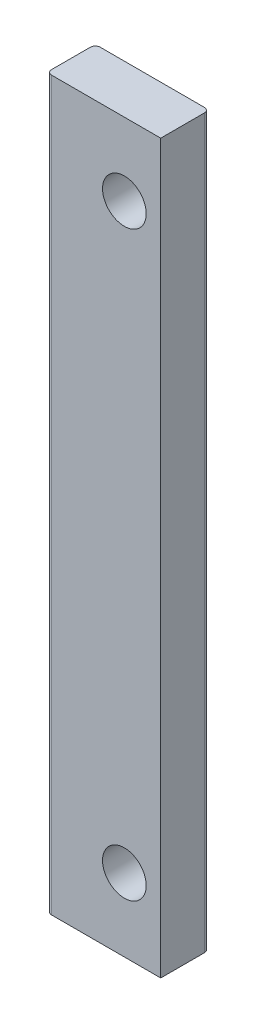
ISO-10303-21;
HEADER;
FILE_DESCRIPTION(('STEP AP214'),'2;1');
FILE_NAME('part.step','',(''),(''),'','','');
FILE_SCHEMA(('AUTOMOTIVE_DESIGN { 1 0 10303 214 1 1 1 1 }'));
ENDSEC;
DATA;
#1=APPLICATION_CONTEXT('core data for automotive mechanical design processes');
#2=APPLICATION_PROTOCOL_DEFINITION('international standard','automotive_design',2000,#1);
#3=PRODUCT_CONTEXT('',#1,'mechanical');
#4=PRODUCT('Part','Part','',(#3));
#5=PRODUCT_RELATED_PRODUCT_CATEGORY('part','',(#4));
#6=PRODUCT_DEFINITION_FORMATION('','',#4);
#7=PRODUCT_DEFINITION_CONTEXT('part definition',#1,'design');
#8=PRODUCT_DEFINITION('design','',#6,#7);
#9=PRODUCT_DEFINITION_SHAPE('','',#8);
#10=(LENGTH_UNIT() NAMED_UNIT(*) SI_UNIT(.MILLI.,.METRE.));
#11=(NAMED_UNIT(*) PLANE_ANGLE_UNIT() SI_UNIT($,.RADIAN.));
#12=(NAMED_UNIT(*) SI_UNIT($,.STERADIAN.) SOLID_ANGLE_UNIT());
#13=UNCERTAINTY_MEASURE_WITH_UNIT(LENGTH_MEASURE(1.E-05),#10,'distance_accuracy_value','');
#14=(GEOMETRIC_REPRESENTATION_CONTEXT(3) GLOBAL_UNCERTAINTY_ASSIGNED_CONTEXT((#13)) GLOBAL_UNIT_ASSIGNED_CONTEXT((#10,
#11,#12)) REPRESENTATION_CONTEXT('',''));
#15=CARTESIAN_POINT('',(0.,0.,0.));
#16=DIRECTION('',(0.,0.,1.));
#17=DIRECTION('',(1.,0.,0.));
#18=AXIS2_PLACEMENT_3D('',#15,#16,#17);
#19=CARTESIAN_POINT('',(11.75,150.,5.));
#20=DIRECTION('',(-1.,0.,0.));
#21=DIRECTION('',(0.,0.,1.));
#22=AXIS2_PLACEMENT_3D('',#19,#20,#21);
#23=PLANE('',#22);
#24=DIRECTION('',(0.,0.,-1.));
#25=VECTOR('',#24,1.);
#26=CARTESIAN_POINT('',(11.75,0.,5.));
#27=LINE('',#26,#25);
#28=CARTESIAN_POINT('',(11.75,0.,5.));
#29=VERTEX_POINT('',#28);
#30=CARTESIAN_POINT('',(11.75,0.,-4.));
#31=VERTEX_POINT('',#30);
#32=EDGE_CURVE('E123',#29,#31,#27,.T.);
#33=ORIENTED_EDGE('',*,*,#32,.T.);
#34=DIRECTION('',(0.,-1.,0.));
#35=VECTOR('',#34,1.);
#36=CARTESIAN_POINT('',(11.75,150.,-4.));
#37=LINE('',#36,#35);
#38=CARTESIAN_POINT('',(11.75,150.,-4.));
#39=VERTEX_POINT('',#38);
#40=EDGE_CURVE('E11',#39,#31,#37,.T.);
#41=ORIENTED_EDGE('',*,*,#40,.F.);
#42=DIRECTION('',(0.,0.,-1.));
#43=VECTOR('',#42,1.);
#44=CARTESIAN_POINT('',(11.75,150.,5.));
#45=LINE('',#44,#43);
#46=CARTESIAN_POINT('',(11.75,150.,5.));
#47=VERTEX_POINT('',#46);
#48=EDGE_CURVE('E136',#47,#39,#45,.T.);
#49=ORIENTED_EDGE('',*,*,#48,.F.);
#50=DIRECTION('',(0.,-1.,0.));
#51=VECTOR('',#50,1.);
#52=CARTESIAN_POINT('',(11.75,150.,5.));
#53=LINE('',#52,#51);
#54=EDGE_CURVE('E119',#47,#29,#53,.T.);
#55=ORIENTED_EDGE('',*,*,#54,.T.);
#56=EDGE_LOOP('',(#33,#41,#49,#55));
#57=FACE_BOUND('',#56,.T.);
#58=ADVANCED_FACE('F33',(#57),#23,.F.);
#59=CARTESIAN_POINT('',(10.75,150.,-4.));
#60=DIRECTION('',(0.,-1.,0.));
#61=DIRECTION('',(0.,0.,-1.));
#62=AXIS2_PLACEMENT_3D('',#59,#60,#61);
#63=CYLINDRICAL_SURFACE('',#62,1.);
#64=CARTESIAN_POINT('',(10.75,0.,-4.));
#65=DIRECTION('',(0.,1.,0.));
#66=DIRECTION('',(0.,0.,-1.));
#67=AXIS2_PLACEMENT_3D('',#64,#65,#66);
#68=CIRCLE('',#67,1.);
#69=CARTESIAN_POINT('',(10.75,0.,-5.));
#70=VERTEX_POINT('',#69);
#71=EDGE_CURVE('E126',#31,#70,#68,.T.);
#72=ORIENTED_EDGE('',*,*,#71,.T.);
#73=DIRECTION('',(0.,-1.,0.));
#74=VECTOR('',#73,1.);
#75=CARTESIAN_POINT('',(10.75,150.,-5.));
#76=LINE('',#75,#74);
#77=CARTESIAN_POINT('',(10.75,150.,-5.));
#78=VERTEX_POINT('',#77);
#79=EDGE_CURVE('E41',#78,#70,#76,.T.);
#80=ORIENTED_EDGE('',*,*,#79,.F.);
#81=CARTESIAN_POINT('',(10.75,150.,-4.));
#82=DIRECTION('',(0.,1.,0.));
#83=DIRECTION('',(0.,0.,-1.));
#84=AXIS2_PLACEMENT_3D('',#81,#82,#83);
#85=CIRCLE('',#84,1.);
#86=EDGE_CURVE('E89',#39,#78,#85,.T.);
#87=ORIENTED_EDGE('',*,*,#86,.F.);
#88=ORIENTED_EDGE('',*,*,#40,.T.);
#89=EDGE_LOOP('',(#72,#80,#87,#88));
#90=FACE_BOUND('',#89,.T.);
#91=ADVANCED_FACE('F175',(#90),#63,.T.);
#92=CARTESIAN_POINT('',(-10.75,150.,-5.));
#93=DIRECTION('',(0.,0.,1.));
#94=DIRECTION('',(1.,0.,0.));
#95=AXIS2_PLACEMENT_3D('',#92,#93,#94);
#96=PLANE('',#95);
#97=CARTESIAN_POINT('',(4.25,135.,-5.));
#98=DIRECTION('',(0.,0.,-1.));
#99=DIRECTION('',(-1.,0.,0.));
#100=AXIS2_PLACEMENT_3D('',#97,#98,#99);
#101=CIRCLE('',#100,4.49999999999999);
#102=CARTESIAN_POINT('',(-0.249999999999985,135.,-5.));
#103=VERTEX_POINT('',#102);
#104=EDGE_CURVE('E167',#103,#103,#101,.T.);
#105=ORIENTED_EDGE('',*,*,#104,.F.);
#106=EDGE_LOOP('',(#105));
#107=FACE_BOUND('',#106,.T.);
#108=CARTESIAN_POINT('',(4.25,15.,-5.));
#109=DIRECTION('',(0.,0.,-1.));
#110=DIRECTION('',(-1.,0.,0.));
#111=AXIS2_PLACEMENT_3D('',#108,#109,#110);
#112=CIRCLE('',#111,4.49999999999999);
#113=CARTESIAN_POINT('',(-0.249999999999985,15.,-5.));
#114=VERTEX_POINT('',#113);
#115=EDGE_CURVE('E161',#114,#114,#112,.T.);
#116=ORIENTED_EDGE('',*,*,#115,.F.);
#117=EDGE_LOOP('',(#116));
#118=FACE_BOUND('',#117,.T.);
#119=DIRECTION('',(-1.,0.,0.));
#120=VECTOR('',#119,1.);
#121=CARTESIAN_POINT('',(-10.75,0.,-5.));
#122=LINE('',#121,#120);
#123=CARTESIAN_POINT('',(-10.75,0.,-5.));
#124=VERTEX_POINT('',#123);
#125=EDGE_CURVE('E129',#70,#124,#122,.T.);
#126=ORIENTED_EDGE('',*,*,#125,.T.);
#127=DIRECTION('',(0.,-1.,0.));
#128=VECTOR('',#127,1.);
#129=CARTESIAN_POINT('',(-10.75,150.,-5.));
#130=LINE('',#129,#128);
#131=CARTESIAN_POINT('',(-10.75,150.,-5.));
#132=VERTEX_POINT('',#131);
#133=EDGE_CURVE('E140',#132,#124,#130,.T.);
#134=ORIENTED_EDGE('',*,*,#133,.F.);
#135=DIRECTION('',(-1.,0.,0.));
#136=VECTOR('',#135,1.);
#137=CARTESIAN_POINT('',(-10.75,150.,-5.));
#138=LINE('',#137,#136);
#139=EDGE_CURVE('E148',#78,#132,#138,.T.);
#140=ORIENTED_EDGE('',*,*,#139,.F.);
#141=ORIENTED_EDGE('',*,*,#79,.T.);
#142=EDGE_LOOP('',(#126,#134,#140,#141));
#143=FACE_BOUND('',#142,.T.);
#144=ADVANCED_FACE('F146',(#107,#118,#143),#96,.F.);
#145=CARTESIAN_POINT('',(-10.75,150.,-4.));
#146=DIRECTION('',(0.,-1.,0.));
#147=DIRECTION('',(0.,0.,-1.));
#148=AXIS2_PLACEMENT_3D('',#145,#146,#147);
#149=CYLINDRICAL_SURFACE('',#148,1.);
#150=CARTESIAN_POINT('',(-10.75,0.,-4.));
#151=DIRECTION('',(0.,1.,0.));
#152=DIRECTION('',(0.,0.,-1.));
#153=AXIS2_PLACEMENT_3D('',#150,#151,#152);
#154=CIRCLE('',#153,1.);
#155=CARTESIAN_POINT('',(-11.75,0.,-4.));
#156=VERTEX_POINT('',#155);
#157=EDGE_CURVE('E131',#124,#156,#154,.T.);
#158=ORIENTED_EDGE('',*,*,#157,.T.);
#159=DIRECTION('',(0.,-1.,0.));
#160=VECTOR('',#159,1.);
#161=CARTESIAN_POINT('',(-11.75,150.,-4.));
#162=LINE('',#161,#160);
#163=CARTESIAN_POINT('',(-11.75,150.,-4.));
#164=VERTEX_POINT('',#163);
#165=EDGE_CURVE('E114',#164,#156,#162,.T.);
#166=ORIENTED_EDGE('',*,*,#165,.F.);
#167=CARTESIAN_POINT('',(-10.75,150.,-4.));
#168=DIRECTION('',(0.,1.,0.));
#169=DIRECTION('',(0.,0.,-1.));
#170=AXIS2_PLACEMENT_3D('',#167,#168,#169);
#171=CIRCLE('',#170,1.);
#172=EDGE_CURVE('E105',#132,#164,#171,.T.);
#173=ORIENTED_EDGE('',*,*,#172,.F.);
#174=ORIENTED_EDGE('',*,*,#133,.T.);
#175=EDGE_LOOP('',(#158,#166,#173,#174));
#176=FACE_BOUND('',#175,.T.);
#177=ADVANCED_FACE('F154',(#176),#149,.T.);
#178=CARTESIAN_POINT('',(-11.75,150.,3.99999999999999));
#179=DIRECTION('',(1.,0.,0.));
#180=DIRECTION('',(0.,0.,-1.));
#181=AXIS2_PLACEMENT_3D('',#178,#179,#180);
#182=PLANE('',#181);
#183=DIRECTION('',(0.,0.,1.));
#184=VECTOR('',#183,1.);
#185=CARTESIAN_POINT('',(-11.75,0.,3.99999999999999));
#186=LINE('',#185,#184);
#187=CARTESIAN_POINT('',(-11.75,0.,3.99999999999999));
#188=VERTEX_POINT('',#187);
#189=EDGE_CURVE('E113',#156,#188,#186,.T.);
#190=ORIENTED_EDGE('',*,*,#189,.T.);
#191=DIRECTION('',(0.,-1.,0.));
#192=VECTOR('',#191,1.);
#193=CARTESIAN_POINT('',(-11.75,150.,3.99999999999999));
#194=LINE('',#193,#192);
#195=CARTESIAN_POINT('',(-11.75,150.,3.99999999999999));
#196=VERTEX_POINT('',#195);
#197=EDGE_CURVE('E110',#196,#188,#194,.T.);
#198=ORIENTED_EDGE('',*,*,#197,.F.);
#199=DIRECTION('',(0.,0.,1.));
#200=VECTOR('',#199,1.);
#201=CARTESIAN_POINT('',(-11.75,150.,3.99999999999999));
#202=LINE('',#201,#200);
#203=EDGE_CURVE('E99',#164,#196,#202,.T.);
#204=ORIENTED_EDGE('',*,*,#203,.F.);
#205=ORIENTED_EDGE('',*,*,#165,.T.);
#206=EDGE_LOOP('',(#190,#198,#204,#205));
#207=FACE_BOUND('',#206,.T.);
#208=ADVANCED_FACE('F111',(#207),#182,.F.);
#209=CARTESIAN_POINT('',(-10.75,150.,4.));
#210=DIRECTION('',(0.,-1.,0.));
#211=DIRECTION('',(0.,0.,-1.));
#212=AXIS2_PLACEMENT_3D('',#209,#210,#211);
#213=CYLINDRICAL_SURFACE('',#212,1.);
#214=CARTESIAN_POINT('',(-10.75,0.,4.));
#215=DIRECTION('',(0.,1.,0.));
#216=DIRECTION('',(0.,0.,-1.));
#217=AXIS2_PLACEMENT_3D('',#214,#215,#216);
#218=CIRCLE('',#217,1.);
#219=CARTESIAN_POINT('',(-10.75,0.,5.));
#220=VERTEX_POINT('',#219);
#221=EDGE_CURVE('E75',#188,#220,#218,.T.);
#222=ORIENTED_EDGE('',*,*,#221,.T.);
#223=DIRECTION('',(0.,-1.,0.));
#224=VECTOR('',#223,1.);
#225=CARTESIAN_POINT('',(-10.75,150.,5.));
#226=LINE('',#225,#224);
#227=CARTESIAN_POINT('',(-10.75,150.,5.));
#228=VERTEX_POINT('',#227);
#229=EDGE_CURVE('E115',#228,#220,#226,.T.);
#230=ORIENTED_EDGE('',*,*,#229,.F.);
#231=CARTESIAN_POINT('',(-10.75,150.,4.));
#232=DIRECTION('',(0.,1.,0.));
#233=DIRECTION('',(0.,0.,-1.));
#234=AXIS2_PLACEMENT_3D('',#231,#232,#233);
#235=CIRCLE('',#234,1.);
#236=EDGE_CURVE('E103',#196,#228,#235,.T.);
#237=ORIENTED_EDGE('',*,*,#236,.F.);
#238=ORIENTED_EDGE('',*,*,#197,.T.);
#239=EDGE_LOOP('',(#222,#230,#237,#238));
#240=FACE_BOUND('',#239,.T.);
#241=ADVANCED_FACE('F117',(#240),#213,.T.);
#242=CARTESIAN_POINT('',(-10.75,150.,5.));
#243=DIRECTION('',(0.,0.,-1.));
#244=DIRECTION('',(-1.,0.,0.));
#245=AXIS2_PLACEMENT_3D('',#242,#243,#244);
#246=PLANE('',#245);
#247=CARTESIAN_POINT('',(4.25,135.,5.));
#248=DIRECTION('',(0.,0.,-1.));
#249=DIRECTION('',(-1.,0.,0.));
#250=AXIS2_PLACEMENT_3D('',#247,#248,#249);
#251=CIRCLE('',#250,4.49999999999999);
#252=CARTESIAN_POINT('',(-0.24999999999999,135.,5.));
#253=VERTEX_POINT('',#252);
#254=EDGE_CURVE('E164',#253,#253,#251,.T.);
#255=ORIENTED_EDGE('',*,*,#254,.T.);
#256=EDGE_LOOP('',(#255));
#257=FACE_BOUND('',#256,.T.);
#258=CARTESIAN_POINT('',(4.25,15.,5.));
#259=DIRECTION('',(0.,0.,-1.));
#260=DIRECTION('',(-1.,0.,0.));
#261=AXIS2_PLACEMENT_3D('',#258,#259,#260);
#262=CIRCLE('',#261,4.49999999999999);
#263=CARTESIAN_POINT('',(-0.24999999999999,15.,5.));
#264=VERTEX_POINT('',#263);
#265=EDGE_CURVE('E127',#264,#264,#262,.T.);
#266=ORIENTED_EDGE('',*,*,#265,.T.);
#267=EDGE_LOOP('',(#266));
#268=FACE_BOUND('',#267,.T.);
#269=DIRECTION('',(1.,0.,0.));
#270=VECTOR('',#269,1.);
#271=CARTESIAN_POINT('',(-10.75,0.,5.));
#272=LINE('',#271,#270);
#273=EDGE_CURVE('E81',#220,#29,#272,.T.);
#274=ORIENTED_EDGE('',*,*,#273,.T.);
#275=ORIENTED_EDGE('',*,*,#54,.F.);
#276=DIRECTION('',(1.,0.,0.));
#277=VECTOR('',#276,1.);
#278=CARTESIAN_POINT('',(-10.75,150.,5.));
#279=LINE('',#278,#277);
#280=EDGE_CURVE('E49',#228,#47,#279,.T.);
#281=ORIENTED_EDGE('',*,*,#280,.F.);
#282=ORIENTED_EDGE('',*,*,#229,.T.);
#283=EDGE_LOOP('',(#274,#275,#281,#282));
#284=FACE_BOUND('',#283,.T.);
#285=ADVANCED_FACE('F199',(#257,#268,#284),#246,.F.);
#286=CARTESIAN_POINT('',(10.75,150.,-4.));
#287=DIRECTION('',(0.,-1.,0.));
#288=DIRECTION('',(0.,0.,-1.));
#289=AXIS2_PLACEMENT_3D('',#286,#287,#288);
#290=PLANE('',#289);
#291=ORIENTED_EDGE('',*,*,#48,.T.);
#292=ORIENTED_EDGE('',*,*,#86,.T.);
#293=ORIENTED_EDGE('',*,*,#139,.T.);
#294=ORIENTED_EDGE('',*,*,#172,.T.);
#295=ORIENTED_EDGE('',*,*,#203,.T.);
#296=ORIENTED_EDGE('',*,*,#236,.T.);
#297=ORIENTED_EDGE('',*,*,#280,.T.);
#298=EDGE_LOOP('',(#291,#292,#293,#294,#295,#296,#297));
#299=FACE_BOUND('',#298,.T.);
#300=ADVANCED_FACE('F101',(#299),#290,.F.);
#301=CARTESIAN_POINT('',(10.75,0.,-4.));
#302=DIRECTION('',(0.,-1.,0.));
#303=DIRECTION('',(0.,0.,-1.));
#304=AXIS2_PLACEMENT_3D('',#301,#302,#303);
#305=PLANE('',#304);
#306=ORIENTED_EDGE('',*,*,#32,.F.);
#307=ORIENTED_EDGE('',*,*,#273,.F.);
#308=ORIENTED_EDGE('',*,*,#221,.F.);
#309=ORIENTED_EDGE('',*,*,#189,.F.);
#310=ORIENTED_EDGE('',*,*,#157,.F.);
#311=ORIENTED_EDGE('',*,*,#125,.F.);
#312=ORIENTED_EDGE('',*,*,#71,.F.);
#313=EDGE_LOOP('',(#306,#307,#308,#309,#310,#311,#312));
#314=FACE_BOUND('',#313,.T.);
#315=ADVANCED_FACE('F152',(#314),#305,.T.);
#316=CARTESIAN_POINT('',(4.25,15.,-5.));
#317=DIRECTION('',(0.,0.,-1.));
#318=DIRECTION('',(-1.,0.,0.));
#319=AXIS2_PLACEMENT_3D('',#316,#317,#318);
#320=CYLINDRICAL_SURFACE('',#319,4.49999999999999);
#321=ORIENTED_EDGE('',*,*,#265,.F.);
#322=EDGE_LOOP('',(#321));
#323=FACE_BOUND('',#322,.T.);
#324=ORIENTED_EDGE('',*,*,#115,.T.);
#325=EDGE_LOOP('',(#324));
#326=FACE_BOUND('',#325,.T.);
#327=ADVANCED_FACE('F179',(#323,#326),#320,.F.);
#328=CARTESIAN_POINT('',(4.25,135.,-5.));
#329=DIRECTION('',(0.,0.,-1.));
#330=DIRECTION('',(-1.,0.,0.));
#331=AXIS2_PLACEMENT_3D('',#328,#329,#330);
#332=CYLINDRICAL_SURFACE('',#331,4.49999999999999);
#333=ORIENTED_EDGE('',*,*,#254,.F.);
#334=EDGE_LOOP('',(#333));
#335=FACE_BOUND('',#334,.T.);
#336=ORIENTED_EDGE('',*,*,#104,.T.);
#337=EDGE_LOOP('',(#336));
#338=FACE_BOUND('',#337,.T.);
#339=ADVANCED_FACE('F171',(#335,#338),#332,.F.);
#340=CLOSED_SHELL('',(#58,#91,#144,#177,#208,#241,#285,#300,#315,#327,#339));
#341=MANIFOLD_SOLID_BREP('B2',#340);
#342=ADVANCED_BREP_SHAPE_REPRESENTATION('',(#18,#341),#14);
#343=SHAPE_DEFINITION_REPRESENTATION(#9,#342);
ENDSEC;
END-ISO-10303-21;
